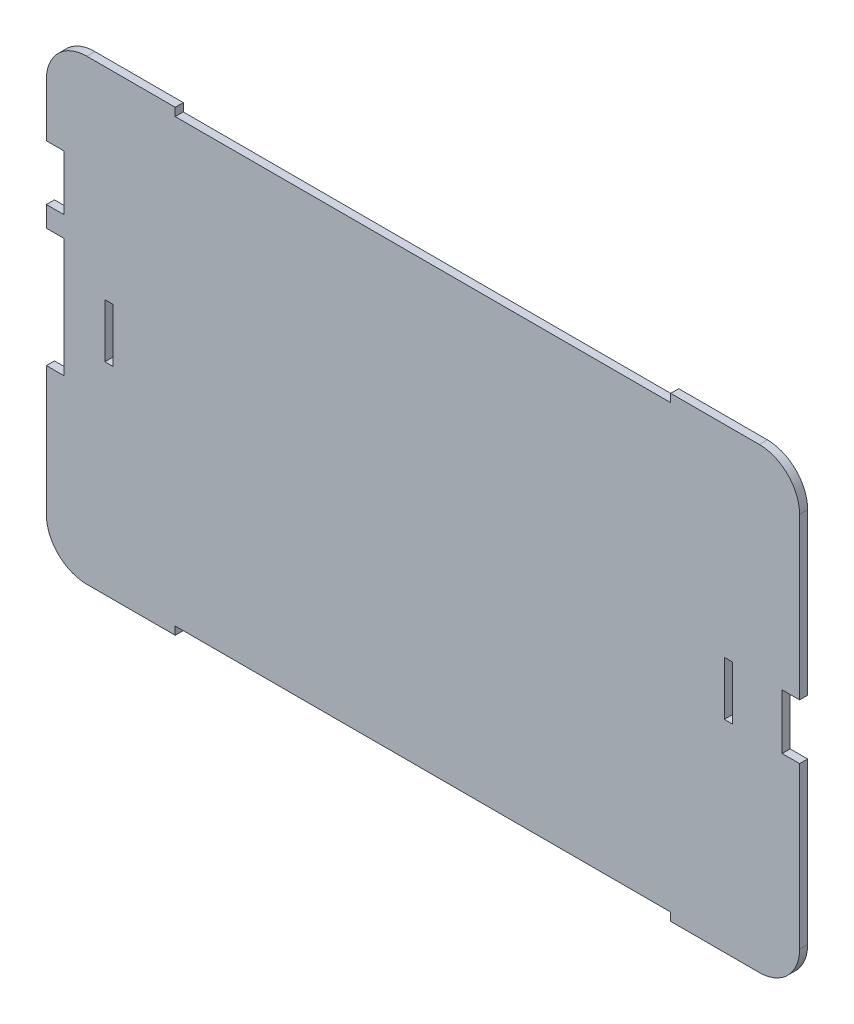
ISO-10303-21;
HEADER;
FILE_DESCRIPTION(('STEP AP214'),'2;1');
FILE_NAME('part.step','',(''),(''),'','','');
FILE_SCHEMA(('AUTOMOTIVE_DESIGN { 1 0 10303 214 1 1 1 1 }'));
ENDSEC;
DATA;
#1=APPLICATION_CONTEXT('core data for automotive mechanical design processes');
#2=APPLICATION_PROTOCOL_DEFINITION('international standard','automotive_design',2000,#1);
#3=PRODUCT_CONTEXT('',#1,'mechanical');
#4=PRODUCT('Part','Part','',(#3));
#5=PRODUCT_RELATED_PRODUCT_CATEGORY('part','',(#4));
#6=PRODUCT_DEFINITION_FORMATION('','',#4);
#7=PRODUCT_DEFINITION_CONTEXT('part definition',#1,'design');
#8=PRODUCT_DEFINITION('design','',#6,#7);
#9=PRODUCT_DEFINITION_SHAPE('','',#8);
#10=(LENGTH_UNIT() NAMED_UNIT(*) SI_UNIT(.MILLI.,.METRE.));
#11=(NAMED_UNIT(*) PLANE_ANGLE_UNIT() SI_UNIT($,.RADIAN.));
#12=(NAMED_UNIT(*) SI_UNIT($,.STERADIAN.) SOLID_ANGLE_UNIT());
#13=UNCERTAINTY_MEASURE_WITH_UNIT(LENGTH_MEASURE(1.E-05),#10,'distance_accuracy_value','');
#14=(GEOMETRIC_REPRESENTATION_CONTEXT(3) GLOBAL_UNCERTAINTY_ASSIGNED_CONTEXT((#13)) GLOBAL_UNIT_ASSIGNED_CONTEXT((#10,
#11,#12)) REPRESENTATION_CONTEXT('',''));
#15=CARTESIAN_POINT('',(0.,0.,0.));
#16=DIRECTION('',(0.,0.,1.));
#17=DIRECTION('',(1.,0.,0.));
#18=AXIS2_PLACEMENT_3D('',#15,#16,#17);
#19=CARTESIAN_POINT('',(57.6551532349819,-12.,3.));
#20=DIRECTION('',(-1.,0.,0.));
#21=DIRECTION('',(0.,-1.,0.));
#22=AXIS2_PLACEMENT_3D('',#19,#20,#21);
#23=PLANE('',#22);
#24=DIRECTION('',(0.,1.,0.));
#25=VECTOR('',#24,1.);
#26=CARTESIAN_POINT('',(57.6551532349819,-12.,3.));
#27=LINE('',#26,#25);
#28=CARTESIAN_POINT('',(57.655153234982,-71.75,3.));
#29=VERTEX_POINT('',#28);
#30=CARTESIAN_POINT('',(57.655153234982,-12.,3.));
#31=VERTEX_POINT('',#30);
#32=EDGE_CURVE('E438',#29,#31,#27,.T.);
#33=ORIENTED_EDGE('',*,*,#32,.F.);
#34=DIRECTION('',(0.,0.,1.));
#35=VECTOR('',#34,1.);
#36=CARTESIAN_POINT('',(57.655153234982,-71.75,0.));
#37=LINE('',#36,#35);
#38=CARTESIAN_POINT('',(57.655153234982,-71.75,0.));
#39=VERTEX_POINT('',#38);
#40=EDGE_CURVE('E357',#39,#29,#37,.T.);
#41=ORIENTED_EDGE('',*,*,#40,.F.);
#42=DIRECTION('',(0.,1.,0.));
#43=VECTOR('',#42,1.);
#44=CARTESIAN_POINT('',(57.6551532349819,-12.,0.));
#45=LINE('',#44,#43);
#46=CARTESIAN_POINT('',(57.655153234982,-12.,0.));
#47=VERTEX_POINT('',#46);
#48=EDGE_CURVE('E476',#39,#47,#45,.T.);
#49=ORIENTED_EDGE('',*,*,#48,.T.);
#50=DIRECTION('',(0.,0.,-1.));
#51=VECTOR('',#50,1.);
#52=CARTESIAN_POINT('',(57.655153234982,-12.,3.));
#53=LINE('',#52,#51);
#54=EDGE_CURVE('E508',#31,#47,#53,.T.);
#55=ORIENTED_EDGE('',*,*,#54,.F.);
#56=EDGE_LOOP('',(#33,#41,#49,#55));
#57=FACE_BOUND('',#56,.T.);
#58=ADVANCED_FACE('F35',(#57),#23,.F.);
#59=CARTESIAN_POINT('',(-222.344846765018,-12.,3.));
#60=DIRECTION('',(1.,0.,0.));
#61=DIRECTION('',(0.,0.,-1.));
#62=AXIS2_PLACEMENT_3D('',#59,#60,#61);
#63=PLANE('',#62);
#64=DIRECTION('',(0.,-1.,0.));
#65=VECTOR('',#64,1.);
#66=CARTESIAN_POINT('',(-222.344846765018,-12.,0.));
#67=LINE('',#66,#65);
#68=CARTESIAN_POINT('',(-222.344846765018,-52.25,0.));
#69=VERTEX_POINT('',#68);
#70=CARTESIAN_POINT('',(-222.344846765018,-59.9,0.));
#71=VERTEX_POINT('',#70);
#72=EDGE_CURVE('E462',#69,#71,#67,.T.);
#73=ORIENTED_EDGE('',*,*,#72,.T.);
#74=DIRECTION('',(0.,0.,1.));
#75=VECTOR('',#74,1.);
#76=CARTESIAN_POINT('',(-222.344846765018,-59.9,0.));
#77=LINE('',#76,#75);
#78=CARTESIAN_POINT('',(-222.344846765018,-59.9,3.));
#79=VERTEX_POINT('',#78);
#80=EDGE_CURVE('E380',#71,#79,#77,.T.);
#81=ORIENTED_EDGE('',*,*,#80,.T.);
#82=DIRECTION('',(0.,-1.,0.));
#83=VECTOR('',#82,1.);
#84=CARTESIAN_POINT('',(-222.344846765018,-12.,3.));
#85=LINE('',#84,#83);
#86=CARTESIAN_POINT('',(-222.344846765018,-52.25,3.));
#87=VERTEX_POINT('',#86);
#88=EDGE_CURVE('E424',#87,#79,#85,.T.);
#89=ORIENTED_EDGE('',*,*,#88,.F.);
#90=DIRECTION('',(0.,0.,1.));
#91=VECTOR('',#90,1.);
#92=CARTESIAN_POINT('',(-222.344846765018,-52.25,0.));
#93=LINE('',#92,#91);
#94=EDGE_CURVE('E409',#69,#87,#93,.T.);
#95=ORIENTED_EDGE('',*,*,#94,.F.);
#96=EDGE_LOOP('',(#73,#81,#89,#95));
#97=FACE_BOUND('',#96,.T.);
#98=ADVANCED_FACE('F569',(#97),#63,.F.);
#99=CARTESIAN_POINT('',(-222.344846765018,-104.1,3.));
#100=VERTEX_POINT('',#99);
#101=CARTESIAN_POINT('',(-222.344846765018,-152.,3.));
#102=VERTEX_POINT('',#101);
#103=EDGE_CURVE('E418',#100,#102,#85,.T.);
#104=ORIENTED_EDGE('',*,*,#103,.F.);
#105=DIRECTION('',(0.,0.,1.));
#106=VECTOR('',#105,1.);
#107=CARTESIAN_POINT('',(-222.344846765018,-104.1,0.));
#108=LINE('',#107,#106);
#109=CARTESIAN_POINT('',(-222.344846765018,-104.1,0.));
#110=VERTEX_POINT('',#109);
#111=EDGE_CURVE('E373',#110,#100,#108,.T.);
#112=ORIENTED_EDGE('',*,*,#111,.F.);
#113=CARTESIAN_POINT('',(-222.344846765018,-152.,0.));
#114=VERTEX_POINT('',#113);
#115=EDGE_CURVE('E457',#110,#114,#67,.T.);
#116=ORIENTED_EDGE('',*,*,#115,.T.);
#117=DIRECTION('',(0.,0.,-1.));
#118=VECTOR('',#117,1.);
#119=CARTESIAN_POINT('',(-222.344846765018,-152.,3.));
#120=LINE('',#119,#118);
#121=EDGE_CURVE('E43',#102,#114,#120,.T.);
#122=ORIENTED_EDGE('',*,*,#121,.F.);
#123=EDGE_LOOP('',(#104,#112,#116,#122));
#124=FACE_BOUND('',#123,.T.);
#125=ADVANCED_FACE('F579',(#124),#63,.F.);
#126=CARTESIAN_POINT('',(-207.344846765018,-12.,3.));
#127=DIRECTION('',(0.,0.,-1.));
#128=DIRECTION('',(-1.,0.,0.));
#129=AXIS2_PLACEMENT_3D('',#126,#127,#128);
#130=CYLINDRICAL_SURFACE('',#129,15.);
#131=CARTESIAN_POINT('',(-207.344846765018,-12.,0.));
#132=DIRECTION('',(0.,0.,1.));
#133=DIRECTION('',(-1.,0.,0.));
#134=AXIS2_PLACEMENT_3D('',#131,#132,#133);
#135=CIRCLE('',#134,15.);
#136=CARTESIAN_POINT('',(-207.344846765018,2.99999999999996,0.));
#137=VERTEX_POINT('',#136);
#138=CARTESIAN_POINT('',(-222.344846765018,-12.,0.));
#139=VERTEX_POINT('',#138);
#140=EDGE_CURVE('E408',#137,#139,#135,.T.);
#141=ORIENTED_EDGE('',*,*,#140,.T.);
#142=DIRECTION('',(0.,0.,-1.));
#143=VECTOR('',#142,1.);
#144=CARTESIAN_POINT('',(-222.344846765018,-12.,3.));
#145=LINE('',#144,#143);
#146=CARTESIAN_POINT('',(-222.344846765018,-12.,3.));
#147=VERTEX_POINT('',#146);
#148=EDGE_CURVE('E11',#147,#139,#145,.T.);
#149=ORIENTED_EDGE('',*,*,#148,.F.);
#150=CARTESIAN_POINT('',(-207.344846765018,-12.,3.));
#151=DIRECTION('',(0.,0.,1.));
#152=DIRECTION('',(-1.,0.,0.));
#153=AXIS2_PLACEMENT_3D('',#150,#151,#152);
#154=CIRCLE('',#153,15.);
#155=CARTESIAN_POINT('',(-207.344846765018,2.99999999999996,3.));
#156=VERTEX_POINT('',#155);
#157=EDGE_CURVE('E415',#156,#147,#154,.T.);
#158=ORIENTED_EDGE('',*,*,#157,.F.);
#159=DIRECTION('',(0.,0.,-1.));
#160=VECTOR('',#159,1.);
#161=CARTESIAN_POINT('',(-207.344846765018,2.99999999999996,3.));
#162=LINE('',#161,#160);
#163=EDGE_CURVE('E454',#156,#137,#162,.T.);
#164=ORIENTED_EDGE('',*,*,#163,.T.);
#165=EDGE_LOOP('',(#141,#149,#158,#164));
#166=FACE_BOUND('',#165,.T.);
#167=ADVANCED_FACE('F37',(#166),#130,.T.);
#168=CARTESIAN_POINT('',(-222.344846765018,-31.75,0.));
#169=VERTEX_POINT('',#168);
#170=EDGE_CURVE('E458',#139,#169,#67,.T.);
#171=ORIENTED_EDGE('',*,*,#170,.T.);
#172=DIRECTION('',(0.,0.,1.));
#173=VECTOR('',#172,1.);
#174=CARTESIAN_POINT('',(-222.344846765018,-31.75,0.));
#175=LINE('',#174,#173);
#176=CARTESIAN_POINT('',(-222.344846765018,-31.75,3.));
#177=VERTEX_POINT('',#176);
#178=EDGE_CURVE('E411',#169,#177,#175,.T.);
#179=ORIENTED_EDGE('',*,*,#178,.T.);
#180=EDGE_CURVE('E420',#147,#177,#85,.T.);
#181=ORIENTED_EDGE('',*,*,#180,.F.);
#182=ORIENTED_EDGE('',*,*,#148,.T.);
#183=EDGE_LOOP('',(#171,#179,#181,#182));
#184=FACE_BOUND('',#183,.T.);
#185=ADVANCED_FACE('F581',(#184),#63,.F.);
#186=CARTESIAN_POINT('',(-207.344846765018,-152.,3.));
#187=DIRECTION('',(0.,0.,-1.));
#188=DIRECTION('',(-1.,0.,0.));
#189=AXIS2_PLACEMENT_3D('',#186,#187,#188);
#190=CYLINDRICAL_SURFACE('',#189,15.);
#191=CARTESIAN_POINT('',(-207.344846765018,-152.,0.));
#192=DIRECTION('',(0.,0.,1.));
#193=DIRECTION('',(1.,0.,0.));
#194=AXIS2_PLACEMENT_3D('',#191,#192,#193);
#195=CIRCLE('',#194,15.);
#196=CARTESIAN_POINT('',(-207.344846765018,-167.,0.));
#197=VERTEX_POINT('',#196);
#198=EDGE_CURVE('E461',#114,#197,#195,.T.);
#199=ORIENTED_EDGE('',*,*,#198,.T.);
#200=DIRECTION('',(0.,0.,-1.));
#201=VECTOR('',#200,1.);
#202=CARTESIAN_POINT('',(-207.344846765018,-167.,3.));
#203=LINE('',#202,#201);
#204=CARTESIAN_POINT('',(-207.344846765018,-167.,3.));
#205=VERTEX_POINT('',#204);
#206=EDGE_CURVE('E529',#205,#197,#203,.T.);
#207=ORIENTED_EDGE('',*,*,#206,.F.);
#208=CARTESIAN_POINT('',(-207.344846765018,-152.,3.));
#209=DIRECTION('',(0.,0.,1.));
#210=DIRECTION('',(1.,0.,0.));
#211=AXIS2_PLACEMENT_3D('',#208,#209,#210);
#212=CIRCLE('',#211,15.);
#213=EDGE_CURVE('E423',#102,#205,#212,.T.);
#214=ORIENTED_EDGE('',*,*,#213,.F.);
#215=ORIENTED_EDGE('',*,*,#121,.T.);
#216=EDGE_LOOP('',(#199,#207,#214,#215));
#217=FACE_BOUND('',#216,.T.);
#218=ADVANCED_FACE('F536',(#217),#190,.T.);
#219=CARTESIAN_POINT('',(-207.344846765018,-167.,3.));
#220=DIRECTION('',(0.,1.,0.));
#221=DIRECTION('',(0.,0.,1.));
#222=AXIS2_PLACEMENT_3D('',#219,#220,#221);
#223=PLANE('',#222);
#224=DIRECTION('',(1.,0.,0.));
#225=VECTOR('',#224,1.);
#226=CARTESIAN_POINT('',(-207.344846765018,-167.,0.));
#227=LINE('',#226,#225);
#228=CARTESIAN_POINT('',(-174.444846765018,-167.,0.));
#229=VERTEX_POINT('',#228);
#230=EDGE_CURVE('E464',#197,#229,#227,.T.);
#231=ORIENTED_EDGE('',*,*,#230,.T.);
#232=DIRECTION('',(0.,0.,-1.));
#233=VECTOR('',#232,1.);
#234=CARTESIAN_POINT('',(-174.444846765018,-167.,3.));
#235=LINE('',#234,#233);
#236=CARTESIAN_POINT('',(-174.444846765018,-167.,3.));
#237=VERTEX_POINT('',#236);
#238=EDGE_CURVE('E526',#237,#229,#235,.T.);
#239=ORIENTED_EDGE('',*,*,#238,.F.);
#240=DIRECTION('',(1.,0.,0.));
#241=VECTOR('',#240,1.);
#242=CARTESIAN_POINT('',(-207.344846765018,-167.,3.));
#243=LINE('',#242,#241);
#244=EDGE_CURVE('E426',#205,#237,#243,.T.);
#245=ORIENTED_EDGE('',*,*,#244,.F.);
#246=ORIENTED_EDGE('',*,*,#206,.T.);
#247=EDGE_LOOP('',(#231,#239,#245,#246));
#248=FACE_BOUND('',#247,.T.);
#249=ADVANCED_FACE('F547',(#248),#223,.F.);
#250=CARTESIAN_POINT('',(-174.444846765018,-167.,3.));
#251=DIRECTION('',(-1.,0.,0.));
#252=DIRECTION('',(0.,-1.,0.));
#253=AXIS2_PLACEMENT_3D('',#250,#251,#252);
#254=PLANE('',#253);
#255=DIRECTION('',(0.,1.,0.));
#256=VECTOR('',#255,1.);
#257=CARTESIAN_POINT('',(-174.444846765018,-167.,0.));
#258=LINE('',#257,#256);
#259=CARTESIAN_POINT('',(-174.444846765018,-164.,0.));
#260=VERTEX_POINT('',#259);
#261=EDGE_CURVE('E466',#229,#260,#258,.T.);
#262=ORIENTED_EDGE('',*,*,#261,.T.);
#263=DIRECTION('',(0.,0.,-1.));
#264=VECTOR('',#263,1.);
#265=CARTESIAN_POINT('',(-174.444846765018,-164.,3.));
#266=LINE('',#265,#264);
#267=CARTESIAN_POINT('',(-174.444846765018,-164.,3.));
#268=VERTEX_POINT('',#267);
#269=EDGE_CURVE('E523',#268,#260,#266,.T.);
#270=ORIENTED_EDGE('',*,*,#269,.F.);
#271=DIRECTION('',(0.,1.,0.));
#272=VECTOR('',#271,1.);
#273=CARTESIAN_POINT('',(-174.444846765018,-167.,3.));
#274=LINE('',#273,#272);
#275=EDGE_CURVE('E428',#237,#268,#274,.T.);
#276=ORIENTED_EDGE('',*,*,#275,.F.);
#277=ORIENTED_EDGE('',*,*,#238,.T.);
#278=EDGE_LOOP('',(#262,#270,#276,#277));
#279=FACE_BOUND('',#278,.T.);
#280=ADVANCED_FACE('F551',(#279),#254,.F.);
#281=CARTESIAN_POINT('',(-174.444846765018,-164.,3.));
#282=DIRECTION('',(0.,1.,0.));
#283=DIRECTION('',(0.,0.,1.));
#284=AXIS2_PLACEMENT_3D('',#281,#282,#283);
#285=PLANE('',#284);
#286=DIRECTION('',(1.,0.,0.));
#287=VECTOR('',#286,1.);
#288=CARTESIAN_POINT('',(-174.444846765018,-164.,0.));
#289=LINE('',#288,#287);
#290=CARTESIAN_POINT('',(9.75515323498197,-164.,0.));
#291=VERTEX_POINT('',#290);
#292=EDGE_CURVE('E468',#260,#291,#289,.T.);
#293=ORIENTED_EDGE('',*,*,#292,.T.);
#294=DIRECTION('',(0.,0.,-1.));
#295=VECTOR('',#294,1.);
#296=CARTESIAN_POINT('',(9.75515323498197,-164.,3.));
#297=LINE('',#296,#295);
#298=CARTESIAN_POINT('',(9.75515323498197,-164.,3.));
#299=VERTEX_POINT('',#298);
#300=EDGE_CURVE('E520',#299,#291,#297,.T.);
#301=ORIENTED_EDGE('',*,*,#300,.F.);
#302=DIRECTION('',(1.,0.,0.));
#303=VECTOR('',#302,1.);
#304=CARTESIAN_POINT('',(-174.444846765018,-164.,3.));
#305=LINE('',#304,#303);
#306=EDGE_CURVE('E430',#268,#299,#305,.T.);
#307=ORIENTED_EDGE('',*,*,#306,.F.);
#308=ORIENTED_EDGE('',*,*,#269,.T.);
#309=EDGE_LOOP('',(#293,#301,#307,#308));
#310=FACE_BOUND('',#309,.T.);
#311=ADVANCED_FACE('F632',(#310),#285,.F.);
#312=CARTESIAN_POINT('',(9.75515323498197,-164.,3.));
#313=DIRECTION('',(1.,0.,0.));
#314=DIRECTION('',(0.,1.,0.));
#315=AXIS2_PLACEMENT_3D('',#312,#313,#314);
#316=PLANE('',#315);
#317=DIRECTION('',(0.,-1.,0.));
#318=VECTOR('',#317,1.);
#319=CARTESIAN_POINT('',(9.75515323498197,-164.,0.));
#320=LINE('',#319,#318);
#321=CARTESIAN_POINT('',(9.75515323498196,-167.,0.));
#322=VERTEX_POINT('',#321);
#323=EDGE_CURVE('E470',#291,#322,#320,.T.);
#324=ORIENTED_EDGE('',*,*,#323,.T.);
#325=DIRECTION('',(0.,0.,-1.));
#326=VECTOR('',#325,1.);
#327=CARTESIAN_POINT('',(9.75515323498196,-167.,3.));
#328=LINE('',#327,#326);
#329=CARTESIAN_POINT('',(9.75515323498196,-167.,3.));
#330=VERTEX_POINT('',#329);
#331=EDGE_CURVE('E517',#330,#322,#328,.T.);
#332=ORIENTED_EDGE('',*,*,#331,.F.);
#333=DIRECTION('',(0.,-1.,0.));
#334=VECTOR('',#333,1.);
#335=CARTESIAN_POINT('',(9.75515323498197,-164.,3.));
#336=LINE('',#335,#334);
#337=EDGE_CURVE('E432',#299,#330,#336,.T.);
#338=ORIENTED_EDGE('',*,*,#337,.F.);
#339=ORIENTED_EDGE('',*,*,#300,.T.);
#340=EDGE_LOOP('',(#324,#332,#338,#339));
#341=FACE_BOUND('',#340,.T.);
#342=ADVANCED_FACE('F629',(#341),#316,.F.);
#343=CARTESIAN_POINT('',(9.75515323498196,-167.,3.));
#344=DIRECTION('',(0.,1.,0.));
#345=DIRECTION('',(-1.,0.,0.));
#346=AXIS2_PLACEMENT_3D('',#343,#344,#345);
#347=PLANE('',#346);
#348=DIRECTION('',(1.,0.,0.));
#349=VECTOR('',#348,1.);
#350=CARTESIAN_POINT('',(9.75515323498196,-167.,0.));
#351=LINE('',#350,#349);
#352=CARTESIAN_POINT('',(42.655153234982,-167.,0.));
#353=VERTEX_POINT('',#352);
#354=EDGE_CURVE('E472',#322,#353,#351,.T.);
#355=ORIENTED_EDGE('',*,*,#354,.T.);
#356=DIRECTION('',(0.,0.,-1.));
#357=VECTOR('',#356,1.);
#358=CARTESIAN_POINT('',(42.655153234982,-167.,3.));
#359=LINE('',#358,#357);
#360=CARTESIAN_POINT('',(42.655153234982,-167.,3.));
#361=VERTEX_POINT('',#360);
#362=EDGE_CURVE('E514',#361,#353,#359,.T.);
#363=ORIENTED_EDGE('',*,*,#362,.F.);
#364=DIRECTION('',(1.,0.,0.));
#365=VECTOR('',#364,1.);
#366=CARTESIAN_POINT('',(9.75515323498196,-167.,3.));
#367=LINE('',#366,#365);
#368=EDGE_CURVE('E434',#330,#361,#367,.T.);
#369=ORIENTED_EDGE('',*,*,#368,.F.);
#370=ORIENTED_EDGE('',*,*,#331,.T.);
#371=EDGE_LOOP('',(#355,#363,#369,#370));
#372=FACE_BOUND('',#371,.T.);
#373=ADVANCED_FACE('F609',(#372),#347,.F.);
#374=CARTESIAN_POINT('',(42.655153234982,-152.,3.));
#375=DIRECTION('',(0.,0.,-1.));
#376=DIRECTION('',(-1.,0.,0.));
#377=AXIS2_PLACEMENT_3D('',#374,#375,#376);
#378=CYLINDRICAL_SURFACE('',#377,15.);
#379=CARTESIAN_POINT('',(42.655153234982,-152.,0.));
#380=DIRECTION('',(0.,0.,1.));
#381=DIRECTION('',(1.,0.,0.));
#382=AXIS2_PLACEMENT_3D('',#379,#380,#381);
#383=CIRCLE('',#382,15.);
#384=CARTESIAN_POINT('',(57.655153234982,-152.,0.));
#385=VERTEX_POINT('',#384);
#386=EDGE_CURVE('E474',#353,#385,#383,.T.);
#387=ORIENTED_EDGE('',*,*,#386,.T.);
#388=DIRECTION('',(0.,0.,-1.));
#389=VECTOR('',#388,1.);
#390=CARTESIAN_POINT('',(57.655153234982,-152.,3.));
#391=LINE('',#390,#389);
#392=CARTESIAN_POINT('',(57.655153234982,-152.,3.));
#393=VERTEX_POINT('',#392);
#394=EDGE_CURVE('E511',#393,#385,#391,.T.);
#395=ORIENTED_EDGE('',*,*,#394,.F.);
#396=CARTESIAN_POINT('',(42.655153234982,-152.,3.));
#397=DIRECTION('',(0.,0.,1.));
#398=DIRECTION('',(1.,0.,0.));
#399=AXIS2_PLACEMENT_3D('',#396,#397,#398);
#400=CIRCLE('',#399,15.);
#401=EDGE_CURVE('E436',#361,#393,#400,.T.);
#402=ORIENTED_EDGE('',*,*,#401,.F.);
#403=ORIENTED_EDGE('',*,*,#362,.T.);
#404=EDGE_LOOP('',(#387,#395,#402,#403));
#405=FACE_BOUND('',#404,.T.);
#406=ADVANCED_FACE('F601',(#405),#378,.T.);
#407=CARTESIAN_POINT('',(57.6551532349819,-92.25,0.));
#408=VERTEX_POINT('',#407);
#409=EDGE_CURVE('E477',#385,#408,#45,.T.);
#410=ORIENTED_EDGE('',*,*,#409,.T.);
#411=DIRECTION('',(0.,0.,1.));
#412=VECTOR('',#411,1.);
#413=CARTESIAN_POINT('',(57.655153234982,-92.25,0.));
#414=LINE('',#413,#412);
#415=CARTESIAN_POINT('',(57.655153234982,-92.25,3.));
#416=VERTEX_POINT('',#415);
#417=EDGE_CURVE('E359',#408,#416,#414,.T.);
#418=ORIENTED_EDGE('',*,*,#417,.T.);
#419=EDGE_CURVE('E439',#393,#416,#27,.T.);
#420=ORIENTED_EDGE('',*,*,#419,.F.);
#421=ORIENTED_EDGE('',*,*,#394,.T.);
#422=EDGE_LOOP('',(#410,#418,#420,#421));
#423=FACE_BOUND('',#422,.T.);
#424=ADVANCED_FACE('F593',(#423),#23,.F.);
#425=CARTESIAN_POINT('',(42.6551532349819,-12.,3.));
#426=DIRECTION('',(0.,0.,-1.));
#427=DIRECTION('',(-1.,0.,0.));
#428=AXIS2_PLACEMENT_3D('',#425,#426,#427);
#429=CYLINDRICAL_SURFACE('',#428,15.);
#430=CARTESIAN_POINT('',(42.6551532349819,-12.,0.));
#431=DIRECTION('',(0.,0.,1.));
#432=DIRECTION('',(-1.,0.,0.));
#433=AXIS2_PLACEMENT_3D('',#430,#431,#432);
#434=CIRCLE('',#433,15.);
#435=CARTESIAN_POINT('',(42.6551532349819,3.,0.));
#436=VERTEX_POINT('',#435);
#437=EDGE_CURVE('E480',#47,#436,#434,.T.);
#438=ORIENTED_EDGE('',*,*,#437,.T.);
#439=DIRECTION('',(0.,0.,-1.));
#440=VECTOR('',#439,1.);
#441=CARTESIAN_POINT('',(42.6551532349819,3.,3.));
#442=LINE('',#441,#440);
#443=CARTESIAN_POINT('',(42.6551532349819,3.,3.));
#444=VERTEX_POINT('',#443);
#445=EDGE_CURVE('E505',#444,#436,#442,.T.);
#446=ORIENTED_EDGE('',*,*,#445,.F.);
#447=CARTESIAN_POINT('',(42.6551532349819,-12.,3.));
#448=DIRECTION('',(0.,0.,1.));
#449=DIRECTION('',(-1.,0.,0.));
#450=AXIS2_PLACEMENT_3D('',#447,#448,#449);
#451=CIRCLE('',#450,15.);
#452=EDGE_CURVE('E442',#31,#444,#451,.T.);
#453=ORIENTED_EDGE('',*,*,#452,.F.);
#454=ORIENTED_EDGE('',*,*,#54,.T.);
#455=EDGE_LOOP('',(#438,#446,#453,#454));
#456=FACE_BOUND('',#455,.T.);
#457=ADVANCED_FACE('F600',(#456),#429,.T.);
#458=CARTESIAN_POINT('',(9.75515323498194,3.,3.));
#459=DIRECTION('',(0.,-1.,0.));
#460=DIRECTION('',(1.,0.,0.));
#461=AXIS2_PLACEMENT_3D('',#458,#459,#460);
#462=PLANE('',#461);
#463=DIRECTION('',(-1.,0.,0.));
#464=VECTOR('',#463,1.);
#465=CARTESIAN_POINT('',(9.75515323498194,3.,0.));
#466=LINE('',#465,#464);
#467=CARTESIAN_POINT('',(9.75515323498194,3.,0.));
#468=VERTEX_POINT('',#467);
#469=EDGE_CURVE('E482',#436,#468,#466,.T.);
#470=ORIENTED_EDGE('',*,*,#469,.T.);
#471=DIRECTION('',(0.,0.,-1.));
#472=VECTOR('',#471,1.);
#473=CARTESIAN_POINT('',(9.75515323498194,3.,3.));
#474=LINE('',#473,#472);
#475=CARTESIAN_POINT('',(9.75515323498194,3.,3.));
#476=VERTEX_POINT('',#475);
#477=EDGE_CURVE('E502',#476,#468,#474,.T.);
#478=ORIENTED_EDGE('',*,*,#477,.F.);
#479=DIRECTION('',(-1.,0.,0.));
#480=VECTOR('',#479,1.);
#481=CARTESIAN_POINT('',(9.75515323498194,3.,3.));
#482=LINE('',#481,#480);
#483=EDGE_CURVE('E444',#444,#476,#482,.T.);
#484=ORIENTED_EDGE('',*,*,#483,.F.);
#485=ORIENTED_EDGE('',*,*,#445,.T.);
#486=EDGE_LOOP('',(#470,#478,#484,#485));
#487=FACE_BOUND('',#486,.T.);
#488=ADVANCED_FACE('F607',(#487),#462,.F.);
#489=CARTESIAN_POINT('',(9.75515323498194,0.,3.));
#490=DIRECTION('',(1.,0.,0.));
#491=DIRECTION('',(0.,0.,-1.));
#492=AXIS2_PLACEMENT_3D('',#489,#490,#491);
#493=PLANE('',#492);
#494=DIRECTION('',(0.,-1.,0.));
#495=VECTOR('',#494,1.);
#496=CARTESIAN_POINT('',(9.75515323498194,0.,0.));
#497=LINE('',#496,#495);
#498=CARTESIAN_POINT('',(9.75515323498194,0.,0.));
#499=VERTEX_POINT('',#498);
#500=EDGE_CURVE('E484',#468,#499,#497,.T.);
#501=ORIENTED_EDGE('',*,*,#500,.T.);
#502=DIRECTION('',(0.,0.,-1.));
#503=VECTOR('',#502,1.);
#504=CARTESIAN_POINT('',(9.75515323498194,0.,3.));
#505=LINE('',#504,#503);
#506=CARTESIAN_POINT('',(9.75515323498194,0.,3.));
#507=VERTEX_POINT('',#506);
#508=EDGE_CURVE('E499',#507,#499,#505,.T.);
#509=ORIENTED_EDGE('',*,*,#508,.F.);
#510=DIRECTION('',(0.,-1.,0.));
#511=VECTOR('',#510,1.);
#512=CARTESIAN_POINT('',(9.75515323498194,0.,3.));
#513=LINE('',#512,#511);
#514=EDGE_CURVE('E446',#476,#507,#513,.T.);
#515=ORIENTED_EDGE('',*,*,#514,.F.);
#516=ORIENTED_EDGE('',*,*,#477,.T.);
#517=EDGE_LOOP('',(#501,#509,#515,#516));
#518=FACE_BOUND('',#517,.T.);
#519=ADVANCED_FACE('F697',(#518),#493,.F.);
#520=CARTESIAN_POINT('',(-174.444846765018,0.,3.));
#521=DIRECTION('',(0.,-1.,0.));
#522=DIRECTION('',(0.,0.,-1.));
#523=AXIS2_PLACEMENT_3D('',#520,#521,#522);
#524=PLANE('',#523);
#525=DIRECTION('',(-1.,0.,0.));
#526=VECTOR('',#525,1.);
#527=CARTESIAN_POINT('',(-174.444846765018,0.,0.));
#528=LINE('',#527,#526);
#529=CARTESIAN_POINT('',(-174.444846765018,0.,0.));
#530=VERTEX_POINT('',#529);
#531=EDGE_CURVE('E486',#499,#530,#528,.T.);
#532=ORIENTED_EDGE('',*,*,#531,.T.);
#533=DIRECTION('',(0.,0.,-1.));
#534=VECTOR('',#533,1.);
#535=CARTESIAN_POINT('',(-174.444846765018,0.,3.));
#536=LINE('',#535,#534);
#537=CARTESIAN_POINT('',(-174.444846765018,0.,3.));
#538=VERTEX_POINT('',#537);
#539=EDGE_CURVE('E496',#538,#530,#536,.T.);
#540=ORIENTED_EDGE('',*,*,#539,.F.);
#541=DIRECTION('',(-1.,0.,0.));
#542=VECTOR('',#541,1.);
#543=CARTESIAN_POINT('',(-174.444846765018,0.,3.));
#544=LINE('',#543,#542);
#545=EDGE_CURVE('E448',#507,#538,#544,.T.);
#546=ORIENTED_EDGE('',*,*,#545,.F.);
#547=ORIENTED_EDGE('',*,*,#508,.T.);
#548=EDGE_LOOP('',(#532,#540,#546,#547));
#549=FACE_BOUND('',#548,.T.);
#550=ADVANCED_FACE('F707',(#549),#524,.F.);
#551=CARTESIAN_POINT('',(-174.444846765018,2.99999999999997,3.));
#552=DIRECTION('',(-1.,0.,0.));
#553=DIRECTION('',(0.,0.,1.));
#554=AXIS2_PLACEMENT_3D('',#551,#552,#553);
#555=PLANE('',#554);
#556=DIRECTION('',(0.,1.,0.));
#557=VECTOR('',#556,1.);
#558=CARTESIAN_POINT('',(-174.444846765018,2.99999999999997,0.));
#559=LINE('',#558,#557);
#560=CARTESIAN_POINT('',(-174.444846765018,2.99999999999997,0.));
#561=VERTEX_POINT('',#560);
#562=EDGE_CURVE('E488',#530,#561,#559,.T.);
#563=ORIENTED_EDGE('',*,*,#562,.T.);
#564=DIRECTION('',(0.,0.,-1.));
#565=VECTOR('',#564,1.);
#566=CARTESIAN_POINT('',(-174.444846765018,2.99999999999997,3.));
#567=LINE('',#566,#565);
#568=CARTESIAN_POINT('',(-174.444846765018,2.99999999999997,3.));
#569=VERTEX_POINT('',#568);
#570=EDGE_CURVE('E493',#569,#561,#567,.T.);
#571=ORIENTED_EDGE('',*,*,#570,.F.);
#572=DIRECTION('',(0.,1.,0.));
#573=VECTOR('',#572,1.);
#574=CARTESIAN_POINT('',(-174.444846765018,2.99999999999997,3.));
#575=LINE('',#574,#573);
#576=EDGE_CURVE('E450',#538,#569,#575,.T.);
#577=ORIENTED_EDGE('',*,*,#576,.F.);
#578=ORIENTED_EDGE('',*,*,#539,.T.);
#579=EDGE_LOOP('',(#563,#571,#577,#578));
#580=FACE_BOUND('',#579,.T.);
#581=ADVANCED_FACE('F717',(#580),#555,.F.);
#582=CARTESIAN_POINT('',(-207.344846765018,2.99999999999996,3.));
#583=DIRECTION('',(0.,-1.,0.));
#584=DIRECTION('',(1.,0.,0.));
#585=AXIS2_PLACEMENT_3D('',#582,#583,#584);
#586=PLANE('',#585);
#587=DIRECTION('',(-1.,0.,0.));
#588=VECTOR('',#587,1.);
#589=CARTESIAN_POINT('',(-207.344846765018,2.99999999999996,0.));
#590=LINE('',#589,#588);
#591=EDGE_CURVE('E419',#561,#137,#590,.T.);
#592=ORIENTED_EDGE('',*,*,#591,.T.);
#593=ORIENTED_EDGE('',*,*,#163,.F.);
#594=DIRECTION('',(-1.,0.,0.));
#595=VECTOR('',#594,1.);
#596=CARTESIAN_POINT('',(-207.344846765018,2.99999999999996,3.));
#597=LINE('',#596,#595);
#598=EDGE_CURVE('E452',#569,#156,#597,.T.);
#599=ORIENTED_EDGE('',*,*,#598,.F.);
#600=ORIENTED_EDGE('',*,*,#570,.T.);
#601=EDGE_LOOP('',(#592,#593,#599,#600));
#602=FACE_BOUND('',#601,.T.);
#603=ADVANCED_FACE('F727',(#602),#586,.F.);
#604=CARTESIAN_POINT('',(-207.344846765018,-12.,3.));
#605=DIRECTION('',(0.,0.,-1.));
#606=DIRECTION('',(-1.,0.,0.));
#607=AXIS2_PLACEMENT_3D('',#604,#605,#606);
#608=PLANE('',#607);
#609=DIRECTION('',(1.,0.,0.));
#610=VECTOR('',#609,1.);
#611=CARTESIAN_POINT('',(32.6551532349819,-92.,3.));
#612=LINE('',#611,#610);
#613=CARTESIAN_POINT('',(29.6551532349819,-92.,3.));
#614=VERTEX_POINT('',#613);
#615=CARTESIAN_POINT('',(32.6551532349819,-92.,3.));
#616=VERTEX_POINT('',#615);
#617=EDGE_CURVE('E295',#614,#616,#612,.T.);
#618=ORIENTED_EDGE('',*,*,#617,.F.);
#619=DIRECTION('',(0.,-1.,0.));
#620=VECTOR('',#619,1.);
#621=CARTESIAN_POINT('',(29.6551532349819,-92.,3.));
#622=LINE('',#621,#620);
#623=CARTESIAN_POINT('',(29.6551532349819,-72.0000000000001,3.));
#624=VERTEX_POINT('',#623);
#625=EDGE_CURVE('E50',#624,#614,#622,.T.);
#626=ORIENTED_EDGE('',*,*,#625,.F.);
#627=DIRECTION('',(-1.,0.,0.));
#628=VECTOR('',#627,1.);
#629=CARTESIAN_POINT('',(32.6551532349819,-72.0000000000001,3.));
#630=LINE('',#629,#628);
#631=CARTESIAN_POINT('',(32.6551532349819,-72.0000000000001,3.));
#632=VERTEX_POINT('',#631);
#633=EDGE_CURVE('E286',#632,#624,#630,.T.);
#634=ORIENTED_EDGE('',*,*,#633,.F.);
#635=DIRECTION('',(0.,1.,0.));
#636=VECTOR('',#635,1.);
#637=CARTESIAN_POINT('',(32.6551532349819,-92.,3.));
#638=LINE('',#637,#636);
#639=EDGE_CURVE('E289',#616,#632,#638,.T.);
#640=ORIENTED_EDGE('',*,*,#639,.F.);
#641=EDGE_LOOP('',(#618,#626,#634,#640));
#642=FACE_BOUND('',#641,.T.);
#643=DIRECTION('',(1.,0.,0.));
#644=VECTOR('',#643,1.);
#645=CARTESIAN_POINT('',(-197.594846765018,-92.0000000000001,3.));
#646=LINE('',#645,#644);
#647=CARTESIAN_POINT('',(-200.594846765018,-92.0000000000001,3.));
#648=VERTEX_POINT('',#647);
#649=CARTESIAN_POINT('',(-197.594846765018,-92.0000000000001,3.));
#650=VERTEX_POINT('',#649);
#651=EDGE_CURVE('E320',#648,#650,#646,.T.);
#652=ORIENTED_EDGE('',*,*,#651,.F.);
#653=DIRECTION('',(0.,-1.,0.));
#654=VECTOR('',#653,1.);
#655=CARTESIAN_POINT('',(-200.594846765018,-92.0000000000001,3.));
#656=LINE('',#655,#654);
#657=CARTESIAN_POINT('',(-200.594846765018,-72.0000000000001,3.));
#658=VERTEX_POINT('',#657);
#659=EDGE_CURVE('E301',#658,#648,#656,.T.);
#660=ORIENTED_EDGE('',*,*,#659,.F.);
#661=DIRECTION('',(-1.,0.,0.));
#662=VECTOR('',#661,1.);
#663=CARTESIAN_POINT('',(-197.594846765018,-72.0000000000001,3.));
#664=LINE('',#663,#662);
#665=CARTESIAN_POINT('',(-197.594846765018,-72.0000000000001,3.));
#666=VERTEX_POINT('',#665);
#667=EDGE_CURVE('E309',#666,#658,#664,.T.);
#668=ORIENTED_EDGE('',*,*,#667,.F.);
#669=DIRECTION('',(0.,1.,0.));
#670=VECTOR('',#669,1.);
#671=CARTESIAN_POINT('',(-197.594846765018,-92.0000000000001,3.));
#672=LINE('',#671,#670);
#673=EDGE_CURVE('E323',#650,#666,#672,.T.);
#674=ORIENTED_EDGE('',*,*,#673,.F.);
#675=EDGE_LOOP('',(#652,#660,#668,#674));
#676=FACE_BOUND('',#675,.T.);
#677=DIRECTION('',(0.,-1.,0.));
#678=VECTOR('',#677,1.);
#679=CARTESIAN_POINT('',(51.1551532349819,-92.25,3.));
#680=LINE('',#679,#678);
#681=CARTESIAN_POINT('',(51.1551532349819,-71.75,3.));
#682=VERTEX_POINT('',#681);
#683=CARTESIAN_POINT('',(51.1551532349819,-92.25,3.));
#684=VERTEX_POINT('',#683);
#685=EDGE_CURVE('E330',#682,#684,#680,.T.);
#686=ORIENTED_EDGE('',*,*,#685,.F.);
#687=DIRECTION('',(-1.,0.,0.));
#688=VECTOR('',#687,1.);
#689=CARTESIAN_POINT('',(57.655153234982,-71.75,3.));
#690=LINE('',#689,#688);
#691=EDGE_CURVE('E341',#29,#682,#690,.T.);
#692=ORIENTED_EDGE('',*,*,#691,.F.);
#693=ORIENTED_EDGE('',*,*,#32,.T.);
#694=ORIENTED_EDGE('',*,*,#452,.T.);
#695=ORIENTED_EDGE('',*,*,#483,.T.);
#696=ORIENTED_EDGE('',*,*,#514,.T.);
#697=ORIENTED_EDGE('',*,*,#545,.T.);
#698=ORIENTED_EDGE('',*,*,#576,.T.);
#699=ORIENTED_EDGE('',*,*,#598,.T.);
#700=ORIENTED_EDGE('',*,*,#157,.T.);
#701=ORIENTED_EDGE('',*,*,#180,.T.);
#702=DIRECTION('',(-1.,0.,0.));
#703=VECTOR('',#702,1.);
#704=CARTESIAN_POINT('',(-222.344846765018,-31.75,3.));
#705=LINE('',#704,#703);
#706=CARTESIAN_POINT('',(-215.844846765018,-31.75,3.));
#707=VERTEX_POINT('',#706);
#708=EDGE_CURVE('E402',#707,#177,#705,.T.);
#709=ORIENTED_EDGE('',*,*,#708,.F.);
#710=DIRECTION('',(0.,1.,0.));
#711=VECTOR('',#710,1.);
#712=CARTESIAN_POINT('',(-215.844846765018,-52.25,3.));
#713=LINE('',#712,#711);
#714=CARTESIAN_POINT('',(-215.844846765018,-52.25,3.));
#715=VERTEX_POINT('',#714);
#716=EDGE_CURVE('E383',#715,#707,#713,.T.);
#717=ORIENTED_EDGE('',*,*,#716,.F.);
#718=DIRECTION('',(1.,0.,0.));
#719=VECTOR('',#718,1.);
#720=CARTESIAN_POINT('',(-222.344846765018,-52.25,3.));
#721=LINE('',#720,#719);
#722=EDGE_CURVE('E393',#87,#715,#721,.T.);
#723=ORIENTED_EDGE('',*,*,#722,.F.);
#724=ORIENTED_EDGE('',*,*,#88,.T.);
#725=DIRECTION('',(-1.,0.,0.));
#726=VECTOR('',#725,1.);
#727=CARTESIAN_POINT('',(-215.844846765018,-59.9,3.));
#728=LINE('',#727,#726);
#729=CARTESIAN_POINT('',(-215.844846765018,-59.9,3.));
#730=VERTEX_POINT('',#729);
#731=EDGE_CURVE('E367',#730,#79,#728,.T.);
#732=ORIENTED_EDGE('',*,*,#731,.F.);
#733=DIRECTION('',(0.,1.,0.));
#734=VECTOR('',#733,1.);
#735=CARTESIAN_POINT('',(-215.844846765018,-104.1,3.));
#736=LINE('',#735,#734);
#737=CARTESIAN_POINT('',(-215.844846765018,-104.1,3.));
#738=VERTEX_POINT('',#737);
#739=EDGE_CURVE('E376',#738,#730,#736,.T.);
#740=ORIENTED_EDGE('',*,*,#739,.F.);
#741=DIRECTION('',(1.,0.,0.));
#742=VECTOR('',#741,1.);
#743=CARTESIAN_POINT('',(-215.844846765018,-104.1,3.));
#744=LINE('',#743,#742);
#745=EDGE_CURVE('E356',#100,#738,#744,.T.);
#746=ORIENTED_EDGE('',*,*,#745,.F.);
#747=ORIENTED_EDGE('',*,*,#103,.T.);
#748=ORIENTED_EDGE('',*,*,#213,.T.);
#749=ORIENTED_EDGE('',*,*,#244,.T.);
#750=ORIENTED_EDGE('',*,*,#275,.T.);
#751=ORIENTED_EDGE('',*,*,#306,.T.);
#752=ORIENTED_EDGE('',*,*,#337,.T.);
#753=ORIENTED_EDGE('',*,*,#368,.T.);
#754=ORIENTED_EDGE('',*,*,#401,.T.);
#755=ORIENTED_EDGE('',*,*,#419,.T.);
#756=DIRECTION('',(1.,0.,0.));
#757=VECTOR('',#756,1.);
#758=CARTESIAN_POINT('',(57.655153234982,-92.25,3.));
#759=LINE('',#758,#757);
#760=EDGE_CURVE('E350',#684,#416,#759,.T.);
#761=ORIENTED_EDGE('',*,*,#760,.F.);
#762=EDGE_LOOP('',(#686,#692,#693,#694,#695,#696,#697,#698,#699,#700,#701,#709,#717,#723,#724,
#732,#740,#746,#747,#748,#749,#750,#751,#752,#753,#754,#755,#761));
#763=FACE_BOUND('',#762,.T.);
#764=ADVANCED_FACE('F556',(#642,#676,#763),#608,.F.);
#765=CARTESIAN_POINT('',(-207.344846765018,-12.,0.));
#766=DIRECTION('',(0.,0.,-1.));
#767=DIRECTION('',(-1.,0.,0.));
#768=AXIS2_PLACEMENT_3D('',#765,#766,#767);
#769=PLANE('',#768);
#770=DIRECTION('',(0.,-1.,0.));
#771=VECTOR('',#770,1.);
#772=CARTESIAN_POINT('',(29.6551532349819,-92.,0.));
#773=LINE('',#772,#771);
#774=CARTESIAN_POINT('',(29.6551532349819,-72.0000000000001,0.));
#775=VERTEX_POINT('',#774);
#776=CARTESIAN_POINT('',(29.6551532349819,-92.,0.));
#777=VERTEX_POINT('',#776);
#778=EDGE_CURVE('E270',#775,#777,#773,.T.);
#779=ORIENTED_EDGE('',*,*,#778,.T.);
#780=DIRECTION('',(1.,0.,0.));
#781=VECTOR('',#780,1.);
#782=CARTESIAN_POINT('',(32.6551532349819,-92.,0.));
#783=LINE('',#782,#781);
#784=CARTESIAN_POINT('',(32.6551532349819,-92.,0.));
#785=VERTEX_POINT('',#784);
#786=EDGE_CURVE('E279',#777,#785,#783,.T.);
#787=ORIENTED_EDGE('',*,*,#786,.T.);
#788=DIRECTION('',(0.,1.,0.));
#789=VECTOR('',#788,1.);
#790=CARTESIAN_POINT('',(32.6551532349819,-92.,0.));
#791=LINE('',#790,#789);
#792=CARTESIAN_POINT('',(32.6551532349819,-72.0000000000001,0.));
#793=VERTEX_POINT('',#792);
#794=EDGE_CURVE('E58',#785,#793,#791,.T.);
#795=ORIENTED_EDGE('',*,*,#794,.T.);
#796=DIRECTION('',(-1.,0.,0.));
#797=VECTOR('',#796,1.);
#798=CARTESIAN_POINT('',(32.6551532349819,-72.0000000000001,0.));
#799=LINE('',#798,#797);
#800=EDGE_CURVE('E276',#793,#775,#799,.T.);
#801=ORIENTED_EDGE('',*,*,#800,.T.);
#802=EDGE_LOOP('',(#779,#787,#795,#801));
#803=FACE_BOUND('',#802,.T.);
#804=DIRECTION('',(0.,-1.,0.));
#805=VECTOR('',#804,1.);
#806=CARTESIAN_POINT('',(-200.594846765018,-92.0000000000001,0.));
#807=LINE('',#806,#805);
#808=CARTESIAN_POINT('',(-200.594846765018,-72.0000000000001,0.));
#809=VERTEX_POINT('',#808);
#810=CARTESIAN_POINT('',(-200.594846765018,-92.0000000000001,0.));
#811=VERTEX_POINT('',#810);
#812=EDGE_CURVE('E305',#809,#811,#807,.T.);
#813=ORIENTED_EDGE('',*,*,#812,.T.);
#814=DIRECTION('',(1.,0.,0.));
#815=VECTOR('',#814,1.);
#816=CARTESIAN_POINT('',(-197.594846765018,-92.0000000000001,0.));
#817=LINE('',#816,#815);
#818=CARTESIAN_POINT('',(-197.594846765018,-92.0000000000001,0.));
#819=VERTEX_POINT('',#818);
#820=EDGE_CURVE('E308',#811,#819,#817,.T.);
#821=ORIENTED_EDGE('',*,*,#820,.T.);
#822=DIRECTION('',(0.,1.,0.));
#823=VECTOR('',#822,1.);
#824=CARTESIAN_POINT('',(-197.594846765018,-92.0000000000001,0.));
#825=LINE('',#824,#823);
#826=CARTESIAN_POINT('',(-197.594846765018,-72.0000000000001,0.));
#827=VERTEX_POINT('',#826);
#828=EDGE_CURVE('E312',#819,#827,#825,.T.);
#829=ORIENTED_EDGE('',*,*,#828,.T.);
#830=DIRECTION('',(-1.,0.,0.));
#831=VECTOR('',#830,1.);
#832=CARTESIAN_POINT('',(-197.594846765018,-72.0000000000001,0.));
#833=LINE('',#832,#831);
#834=EDGE_CURVE('E315',#827,#809,#833,.T.);
#835=ORIENTED_EDGE('',*,*,#834,.T.);
#836=EDGE_LOOP('',(#813,#821,#829,#835));
#837=FACE_BOUND('',#836,.T.);
#838=DIRECTION('',(-1.,0.,0.));
#839=VECTOR('',#838,1.);
#840=CARTESIAN_POINT('',(57.655153234982,-71.75,0.));
#841=LINE('',#840,#839);
#842=CARTESIAN_POINT('',(51.1551532349819,-71.75,0.));
#843=VERTEX_POINT('',#842);
#844=EDGE_CURVE('E344',#39,#843,#841,.T.);
#845=ORIENTED_EDGE('',*,*,#844,.T.);
#846=DIRECTION('',(0.,-1.,0.));
#847=VECTOR('',#846,1.);
#848=CARTESIAN_POINT('',(51.1551532349819,-92.25,0.));
#849=LINE('',#848,#847);
#850=CARTESIAN_POINT('',(51.1551532349819,-92.25,0.));
#851=VERTEX_POINT('',#850);
#852=EDGE_CURVE('E337',#843,#851,#849,.T.);
#853=ORIENTED_EDGE('',*,*,#852,.T.);
#854=DIRECTION('',(1.,0.,0.));
#855=VECTOR('',#854,1.);
#856=CARTESIAN_POINT('',(57.655153234982,-92.25,0.));
#857=LINE('',#856,#855);
#858=EDGE_CURVE('E340',#851,#408,#857,.T.);
#859=ORIENTED_EDGE('',*,*,#858,.T.);
#860=ORIENTED_EDGE('',*,*,#409,.F.);
#861=ORIENTED_EDGE('',*,*,#386,.F.);
#862=ORIENTED_EDGE('',*,*,#354,.F.);
#863=ORIENTED_EDGE('',*,*,#323,.F.);
#864=ORIENTED_EDGE('',*,*,#292,.F.);
#865=ORIENTED_EDGE('',*,*,#261,.F.);
#866=ORIENTED_EDGE('',*,*,#230,.F.);
#867=ORIENTED_EDGE('',*,*,#198,.F.);
#868=ORIENTED_EDGE('',*,*,#115,.F.);
#869=DIRECTION('',(1.,0.,0.));
#870=VECTOR('',#869,1.);
#871=CARTESIAN_POINT('',(-215.844846765018,-104.1,0.));
#872=LINE('',#871,#870);
#873=CARTESIAN_POINT('',(-215.844846765018,-104.1,0.));
#874=VERTEX_POINT('',#873);
#875=EDGE_CURVE('E363',#110,#874,#872,.T.);
#876=ORIENTED_EDGE('',*,*,#875,.T.);
#877=DIRECTION('',(0.,1.,0.));
#878=VECTOR('',#877,1.);
#879=CARTESIAN_POINT('',(-215.844846765018,-104.1,0.));
#880=LINE('',#879,#878);
#881=CARTESIAN_POINT('',(-215.844846765018,-59.9,0.));
#882=VERTEX_POINT('',#881);
#883=EDGE_CURVE('E366',#874,#882,#880,.T.);
#884=ORIENTED_EDGE('',*,*,#883,.T.);
#885=DIRECTION('',(-1.,0.,0.));
#886=VECTOR('',#885,1.);
#887=CARTESIAN_POINT('',(-215.844846765018,-59.9,0.));
#888=LINE('',#887,#886);
#889=EDGE_CURVE('E370',#882,#71,#888,.T.);
#890=ORIENTED_EDGE('',*,*,#889,.T.);
#891=ORIENTED_EDGE('',*,*,#72,.F.);
#892=DIRECTION('',(1.,0.,0.));
#893=VECTOR('',#892,1.);
#894=CARTESIAN_POINT('',(-222.344846765018,-52.25,0.));
#895=LINE('',#894,#893);
#896=CARTESIAN_POINT('',(-215.844846765018,-52.25,0.));
#897=VERTEX_POINT('',#896);
#898=EDGE_CURVE('E396',#69,#897,#895,.T.);
#899=ORIENTED_EDGE('',*,*,#898,.T.);
#900=DIRECTION('',(0.,1.,0.));
#901=VECTOR('',#900,1.);
#902=CARTESIAN_POINT('',(-215.844846765018,-52.25,0.));
#903=LINE('',#902,#901);
#904=CARTESIAN_POINT('',(-215.844846765018,-31.75,0.));
#905=VERTEX_POINT('',#904);
#906=EDGE_CURVE('E389',#897,#905,#903,.T.);
#907=ORIENTED_EDGE('',*,*,#906,.T.);
#908=DIRECTION('',(-1.,0.,0.));
#909=VECTOR('',#908,1.);
#910=CARTESIAN_POINT('',(-222.344846765018,-31.75,0.));
#911=LINE('',#910,#909);
#912=EDGE_CURVE('E392',#905,#169,#911,.T.);
#913=ORIENTED_EDGE('',*,*,#912,.T.);
#914=ORIENTED_EDGE('',*,*,#170,.F.);
#915=ORIENTED_EDGE('',*,*,#140,.F.);
#916=ORIENTED_EDGE('',*,*,#591,.F.);
#917=ORIENTED_EDGE('',*,*,#562,.F.);
#918=ORIENTED_EDGE('',*,*,#531,.F.);
#919=ORIENTED_EDGE('',*,*,#500,.F.);
#920=ORIENTED_EDGE('',*,*,#469,.F.);
#921=ORIENTED_EDGE('',*,*,#437,.F.);
#922=ORIENTED_EDGE('',*,*,#48,.F.);
#923=EDGE_LOOP('',(#845,#853,#859,#860,#861,#862,#863,#864,#865,#866,#867,#868,#876,#884,#890,
#891,#899,#907,#913,#914,#915,#916,#917,#918,#919,#920,#921,#922));
#924=FACE_BOUND('',#923,.T.);
#925=ADVANCED_FACE('F283',(#803,#837,#924),#769,.T.);
#926=CARTESIAN_POINT('',(-215.844846765018,-52.25,0.));
#927=DIRECTION('',(1.,0.,0.));
#928=DIRECTION('',(0.,0.,-1.));
#929=AXIS2_PLACEMENT_3D('',#926,#927,#928);
#930=PLANE('',#929);
#931=ORIENTED_EDGE('',*,*,#716,.T.);
#932=DIRECTION('',(0.,0.,1.));
#933=VECTOR('',#932,1.);
#934=CARTESIAN_POINT('',(-215.844846765018,-31.75,0.));
#935=LINE('',#934,#933);
#936=EDGE_CURVE('E399',#905,#707,#935,.T.);
#937=ORIENTED_EDGE('',*,*,#936,.F.);
#938=ORIENTED_EDGE('',*,*,#906,.F.);
#939=DIRECTION('',(0.,0.,1.));
#940=VECTOR('',#939,1.);
#941=CARTESIAN_POINT('',(-215.844846765018,-52.25,0.));
#942=LINE('',#941,#940);
#943=EDGE_CURVE('E406',#897,#715,#942,.T.);
#944=ORIENTED_EDGE('',*,*,#943,.T.);
#945=EDGE_LOOP('',(#931,#937,#938,#944));
#946=FACE_BOUND('',#945,.T.);
#947=ADVANCED_FACE('F778',(#946),#930,.F.);
#948=CARTESIAN_POINT('',(-222.344846765018,-52.25,0.));
#949=DIRECTION('',(0.,-1.,0.));
#950=DIRECTION('',(0.,0.,-1.));
#951=AXIS2_PLACEMENT_3D('',#948,#949,#950);
#952=PLANE('',#951);
#953=ORIENTED_EDGE('',*,*,#722,.T.);
#954=ORIENTED_EDGE('',*,*,#943,.F.);
#955=ORIENTED_EDGE('',*,*,#898,.F.);
#956=ORIENTED_EDGE('',*,*,#94,.T.);
#957=EDGE_LOOP('',(#953,#954,#955,#956));
#958=FACE_BOUND('',#957,.T.);
#959=ADVANCED_FACE('F786',(#958),#952,.F.);
#960=CARTESIAN_POINT('',(-222.344846765018,-31.75,0.));
#961=DIRECTION('',(0.,1.,0.));
#962=DIRECTION('',(0.,0.,1.));
#963=AXIS2_PLACEMENT_3D('',#960,#961,#962);
#964=PLANE('',#963);
#965=ORIENTED_EDGE('',*,*,#708,.T.);
#966=ORIENTED_EDGE('',*,*,#178,.F.);
#967=ORIENTED_EDGE('',*,*,#912,.F.);
#968=ORIENTED_EDGE('',*,*,#936,.T.);
#969=EDGE_LOOP('',(#965,#966,#967,#968));
#970=FACE_BOUND('',#969,.T.);
#971=ADVANCED_FACE('F796',(#970),#964,.F.);
#972=CARTESIAN_POINT('',(-215.844846765018,-59.9,0.));
#973=DIRECTION('',(0.,1.,0.));
#974=DIRECTION('',(0.,0.,1.));
#975=AXIS2_PLACEMENT_3D('',#972,#973,#974);
#976=PLANE('',#975);
#977=ORIENTED_EDGE('',*,*,#731,.T.);
#978=ORIENTED_EDGE('',*,*,#80,.F.);
#979=ORIENTED_EDGE('',*,*,#889,.F.);
#980=DIRECTION('',(0.,0.,1.));
#981=VECTOR('',#980,1.);
#982=CARTESIAN_POINT('',(-215.844846765018,-59.9,0.));
#983=LINE('',#982,#981);
#984=EDGE_CURVE('E384',#882,#730,#983,.T.);
#985=ORIENTED_EDGE('',*,*,#984,.T.);
#986=EDGE_LOOP('',(#977,#978,#979,#985));
#987=FACE_BOUND('',#986,.T.);
#988=ADVANCED_FACE('F573',(#987),#976,.F.);
#989=CARTESIAN_POINT('',(-215.844846765018,-104.1,0.));
#990=DIRECTION('',(1.,0.,0.));
#991=DIRECTION('',(0.,0.,-1.));
#992=AXIS2_PLACEMENT_3D('',#989,#990,#991);
#993=PLANE('',#992);
#994=ORIENTED_EDGE('',*,*,#739,.T.);
#995=ORIENTED_EDGE('',*,*,#984,.F.);
#996=ORIENTED_EDGE('',*,*,#883,.F.);
#997=DIRECTION('',(0.,0.,1.));
#998=VECTOR('',#997,1.);
#999=CARTESIAN_POINT('',(-215.844846765018,-104.1,0.));
#1000=LINE('',#999,#998);
#1001=EDGE_CURVE('E386',#874,#738,#1000,.T.);
#1002=ORIENTED_EDGE('',*,*,#1001,.T.);
#1003=EDGE_LOOP('',(#994,#995,#996,#1002));
#1004=FACE_BOUND('',#1003,.T.);
#1005=ADVANCED_FACE('F576',(#1004),#993,.F.);
#1006=CARTESIAN_POINT('',(-215.844846765018,-104.1,0.));
#1007=DIRECTION('',(0.,-1.,0.));
#1008=DIRECTION('',(0.,0.,-1.));
#1009=AXIS2_PLACEMENT_3D('',#1006,#1007,#1008);
#1010=PLANE('',#1009);
#1011=ORIENTED_EDGE('',*,*,#745,.T.);
#1012=ORIENTED_EDGE('',*,*,#1001,.F.);
#1013=ORIENTED_EDGE('',*,*,#875,.F.);
#1014=ORIENTED_EDGE('',*,*,#111,.T.);
#1015=EDGE_LOOP('',(#1011,#1012,#1013,#1014));
#1016=FACE_BOUND('',#1015,.T.);
#1017=ADVANCED_FACE('F578',(#1016),#1010,.F.);
#1018=CARTESIAN_POINT('',(51.1551532349819,-92.25,0.));
#1019=DIRECTION('',(-1.,0.,0.));
#1020=DIRECTION('',(0.,0.,1.));
#1021=AXIS2_PLACEMENT_3D('',#1018,#1019,#1020);
#1022=PLANE('',#1021);
#1023=ORIENTED_EDGE('',*,*,#685,.T.);
#1024=DIRECTION('',(0.,0.,1.));
#1025=VECTOR('',#1024,1.);
#1026=CARTESIAN_POINT('',(51.1551532349819,-92.25,0.));
#1027=LINE('',#1026,#1025);
#1028=EDGE_CURVE('E347',#851,#684,#1027,.T.);
#1029=ORIENTED_EDGE('',*,*,#1028,.F.);
#1030=ORIENTED_EDGE('',*,*,#852,.F.);
#1031=DIRECTION('',(0.,0.,1.));
#1032=VECTOR('',#1031,1.);
#1033=CARTESIAN_POINT('',(51.1551532349819,-71.75,0.));
#1034=LINE('',#1033,#1032);
#1035=EDGE_CURVE('E354',#843,#682,#1034,.T.);
#1036=ORIENTED_EDGE('',*,*,#1035,.T.);
#1037=EDGE_LOOP('',(#1023,#1029,#1030,#1036));
#1038=FACE_BOUND('',#1037,.T.);
#1039=ADVANCED_FACE('F831',(#1038),#1022,.F.);
#1040=CARTESIAN_POINT('',(57.655153234982,-71.75,0.));
#1041=DIRECTION('',(0.,1.,0.));
#1042=DIRECTION('',(-1.,0.,0.));
#1043=AXIS2_PLACEMENT_3D('',#1040,#1041,#1042);
#1044=PLANE('',#1043);
#1045=ORIENTED_EDGE('',*,*,#691,.T.);
#1046=ORIENTED_EDGE('',*,*,#1035,.F.);
#1047=ORIENTED_EDGE('',*,*,#844,.F.);
#1048=ORIENTED_EDGE('',*,*,#40,.T.);
#1049=EDGE_LOOP('',(#1045,#1046,#1047,#1048));
#1050=FACE_BOUND('',#1049,.T.);
#1051=ADVANCED_FACE('F840',(#1050),#1044,.F.);
#1052=CARTESIAN_POINT('',(57.655153234982,-92.25,0.));
#1053=DIRECTION('',(0.,-1.,0.));
#1054=DIRECTION('',(1.,0.,0.));
#1055=AXIS2_PLACEMENT_3D('',#1052,#1053,#1054);
#1056=PLANE('',#1055);
#1057=ORIENTED_EDGE('',*,*,#760,.T.);
#1058=ORIENTED_EDGE('',*,*,#417,.F.);
#1059=ORIENTED_EDGE('',*,*,#858,.F.);
#1060=ORIENTED_EDGE('',*,*,#1028,.T.);
#1061=EDGE_LOOP('',(#1057,#1058,#1059,#1060));
#1062=FACE_BOUND('',#1061,.T.);
#1063=ADVANCED_FACE('F619',(#1062),#1056,.F.);
#1064=CARTESIAN_POINT('',(-200.594846765018,-92.0000000000001,0.));
#1065=DIRECTION('',(-1.,0.,0.));
#1066=DIRECTION('',(0.,0.,1.));
#1067=AXIS2_PLACEMENT_3D('',#1064,#1065,#1066);
#1068=PLANE('',#1067);
#1069=ORIENTED_EDGE('',*,*,#659,.T.);
#1070=DIRECTION('',(0.,0.,1.));
#1071=VECTOR('',#1070,1.);
#1072=CARTESIAN_POINT('',(-200.594846765018,-92.0000000000001,0.));
#1073=LINE('',#1072,#1071);
#1074=EDGE_CURVE('E318',#811,#648,#1073,.T.);
#1075=ORIENTED_EDGE('',*,*,#1074,.F.);
#1076=ORIENTED_EDGE('',*,*,#812,.F.);
#1077=DIRECTION('',(0.,0.,1.));
#1078=VECTOR('',#1077,1.);
#1079=CARTESIAN_POINT('',(-200.594846765018,-72.0000000000001,0.));
#1080=LINE('',#1079,#1078);
#1081=EDGE_CURVE('E328',#809,#658,#1080,.T.);
#1082=ORIENTED_EDGE('',*,*,#1081,.T.);
#1083=EDGE_LOOP('',(#1069,#1075,#1076,#1082));
#1084=FACE_BOUND('',#1083,.T.);
#1085=ADVANCED_FACE('F859',(#1084),#1068,.F.);
#1086=CARTESIAN_POINT('',(-197.594846765018,-72.0000000000001,0.));
#1087=DIRECTION('',(0.,1.,0.));
#1088=DIRECTION('',(0.,0.,1.));
#1089=AXIS2_PLACEMENT_3D('',#1086,#1087,#1088);
#1090=PLANE('',#1089);
#1091=ORIENTED_EDGE('',*,*,#667,.T.);
#1092=ORIENTED_EDGE('',*,*,#1081,.F.);
#1093=ORIENTED_EDGE('',*,*,#834,.F.);
#1094=DIRECTION('',(0.,0.,1.));
#1095=VECTOR('',#1094,1.);
#1096=CARTESIAN_POINT('',(-197.594846765018,-72.0000000000001,0.));
#1097=LINE('',#1096,#1095);
#1098=EDGE_CURVE('E331',#827,#666,#1097,.T.);
#1099=ORIENTED_EDGE('',*,*,#1098,.T.);
#1100=EDGE_LOOP('',(#1091,#1092,#1093,#1099));
#1101=FACE_BOUND('',#1100,.T.);
#1102=ADVANCED_FACE('F868',(#1101),#1090,.F.);
#1103=CARTESIAN_POINT('',(-197.594846765018,-92.0000000000001,0.));
#1104=DIRECTION('',(1.,0.,0.));
#1105=DIRECTION('',(0.,0.,-1.));
#1106=AXIS2_PLACEMENT_3D('',#1103,#1104,#1105);
#1107=PLANE('',#1106);
#1108=ORIENTED_EDGE('',*,*,#673,.T.);
#1109=ORIENTED_EDGE('',*,*,#1098,.F.);
#1110=ORIENTED_EDGE('',*,*,#828,.F.);
#1111=DIRECTION('',(0.,0.,1.));
#1112=VECTOR('',#1111,1.);
#1113=CARTESIAN_POINT('',(-197.594846765018,-92.0000000000001,0.));
#1114=LINE('',#1113,#1112);
#1115=EDGE_CURVE('E333',#819,#650,#1114,.T.);
#1116=ORIENTED_EDGE('',*,*,#1115,.T.);
#1117=EDGE_LOOP('',(#1108,#1109,#1110,#1116));
#1118=FACE_BOUND('',#1117,.T.);
#1119=ADVANCED_FACE('F878',(#1118),#1107,.F.);
#1120=CARTESIAN_POINT('',(-197.594846765018,-92.0000000000001,0.));
#1121=DIRECTION('',(0.,-1.,0.));
#1122=DIRECTION('',(0.,0.,-1.));
#1123=AXIS2_PLACEMENT_3D('',#1120,#1121,#1122);
#1124=PLANE('',#1123);
#1125=ORIENTED_EDGE('',*,*,#651,.T.);
#1126=ORIENTED_EDGE('',*,*,#1115,.F.);
#1127=ORIENTED_EDGE('',*,*,#820,.F.);
#1128=ORIENTED_EDGE('',*,*,#1074,.T.);
#1129=EDGE_LOOP('',(#1125,#1126,#1127,#1128));
#1130=FACE_BOUND('',#1129,.T.);
#1131=ADVANCED_FACE('F888',(#1130),#1124,.F.);
#1132=CARTESIAN_POINT('',(29.6551532349819,-92.,0.));
#1133=DIRECTION('',(-1.,0.,0.));
#1134=DIRECTION('',(0.,-1.,0.));
#1135=AXIS2_PLACEMENT_3D('',#1132,#1133,#1134);
#1136=PLANE('',#1135);
#1137=ORIENTED_EDGE('',*,*,#625,.T.);
#1138=DIRECTION('',(0.,0.,1.));
#1139=VECTOR('',#1138,1.);
#1140=CARTESIAN_POINT('',(29.6551532349819,-92.,0.));
#1141=LINE('',#1140,#1139);
#1142=EDGE_CURVE('E266',#777,#614,#1141,.T.);
#1143=ORIENTED_EDGE('',*,*,#1142,.F.);
#1144=ORIENTED_EDGE('',*,*,#778,.F.);
#1145=DIRECTION('',(0.,0.,1.));
#1146=VECTOR('',#1145,1.);
#1147=CARTESIAN_POINT('',(29.6551532349819,-72.0000000000001,0.));
#1148=LINE('',#1147,#1146);
#1149=EDGE_CURVE('E299',#775,#624,#1148,.T.);
#1150=ORIENTED_EDGE('',*,*,#1149,.T.);
#1151=EDGE_LOOP('',(#1137,#1143,#1144,#1150));
#1152=FACE_BOUND('',#1151,.T.);
#1153=ADVANCED_FACE('F268',(#1152),#1136,.F.);
#1154=CARTESIAN_POINT('',(32.6551532349819,-72.0000000000001,0.));
#1155=DIRECTION('',(0.,1.,0.));
#1156=DIRECTION('',(0.,0.,1.));
#1157=AXIS2_PLACEMENT_3D('',#1154,#1155,#1156);
#1158=PLANE('',#1157);
#1159=ORIENTED_EDGE('',*,*,#633,.T.);
#1160=ORIENTED_EDGE('',*,*,#1149,.F.);
#1161=ORIENTED_EDGE('',*,*,#800,.F.);
#1162=DIRECTION('',(0.,0.,1.));
#1163=VECTOR('',#1162,1.);
#1164=CARTESIAN_POINT('',(32.6551532349819,-72.0000000000001,0.));
#1165=LINE('',#1164,#1163);
#1166=EDGE_CURVE('E302',#793,#632,#1165,.T.);
#1167=ORIENTED_EDGE('',*,*,#1166,.T.);
#1168=EDGE_LOOP('',(#1159,#1160,#1161,#1167));
#1169=FACE_BOUND('',#1168,.T.);
#1170=ADVANCED_FACE('F907',(#1169),#1158,.F.);
#1171=CARTESIAN_POINT('',(32.6551532349819,-92.,0.));
#1172=DIRECTION('',(1.,0.,0.));
#1173=DIRECTION('',(0.,0.,-1.));
#1174=AXIS2_PLACEMENT_3D('',#1171,#1172,#1173);
#1175=PLANE('',#1174);
#1176=ORIENTED_EDGE('',*,*,#639,.T.);
#1177=ORIENTED_EDGE('',*,*,#1166,.F.);
#1178=ORIENTED_EDGE('',*,*,#794,.F.);
#1179=DIRECTION('',(0.,0.,1.));
#1180=VECTOR('',#1179,1.);
#1181=CARTESIAN_POINT('',(32.6551532349819,-92.,0.));
#1182=LINE('',#1181,#1180);
#1183=EDGE_CURVE('E275',#785,#616,#1182,.T.);
#1184=ORIENTED_EDGE('',*,*,#1183,.T.);
#1185=EDGE_LOOP('',(#1176,#1177,#1178,#1184));
#1186=FACE_BOUND('',#1185,.T.);
#1187=ADVANCED_FACE('F916',(#1186),#1175,.F.);
#1188=CARTESIAN_POINT('',(32.6551532349819,-92.,0.));
#1189=DIRECTION('',(0.,-1.,0.));
#1190=DIRECTION('',(0.,0.,-1.));
#1191=AXIS2_PLACEMENT_3D('',#1188,#1189,#1190);
#1192=PLANE('',#1191);
#1193=ORIENTED_EDGE('',*,*,#617,.T.);
#1194=ORIENTED_EDGE('',*,*,#1183,.F.);
#1195=ORIENTED_EDGE('',*,*,#786,.F.);
#1196=ORIENTED_EDGE('',*,*,#1142,.T.);
#1197=EDGE_LOOP('',(#1193,#1194,#1195,#1196));
#1198=FACE_BOUND('',#1197,.T.);
#1199=ADVANCED_FACE('F280',(#1198),#1192,.F.);
#1200=CLOSED_SHELL('',(#58,#98,#125,#167,#185,#218,#249,#280,#311,#342,#373,#406,#424,#457,#488,
#519,#550,#581,#603,#764,#925,#947,#959,#971,#988,#1005,#1017,#1039,#1051,#1063,#1085,#1102,
#1119,#1131,#1153,#1170,#1187,#1199));
#1201=MANIFOLD_SOLID_BREP('B2',#1200);
#1202=ADVANCED_BREP_SHAPE_REPRESENTATION('',(#18,#1201),#14);
#1203=SHAPE_DEFINITION_REPRESENTATION(#9,#1202);
ENDSEC;
END-ISO-10303-21;
